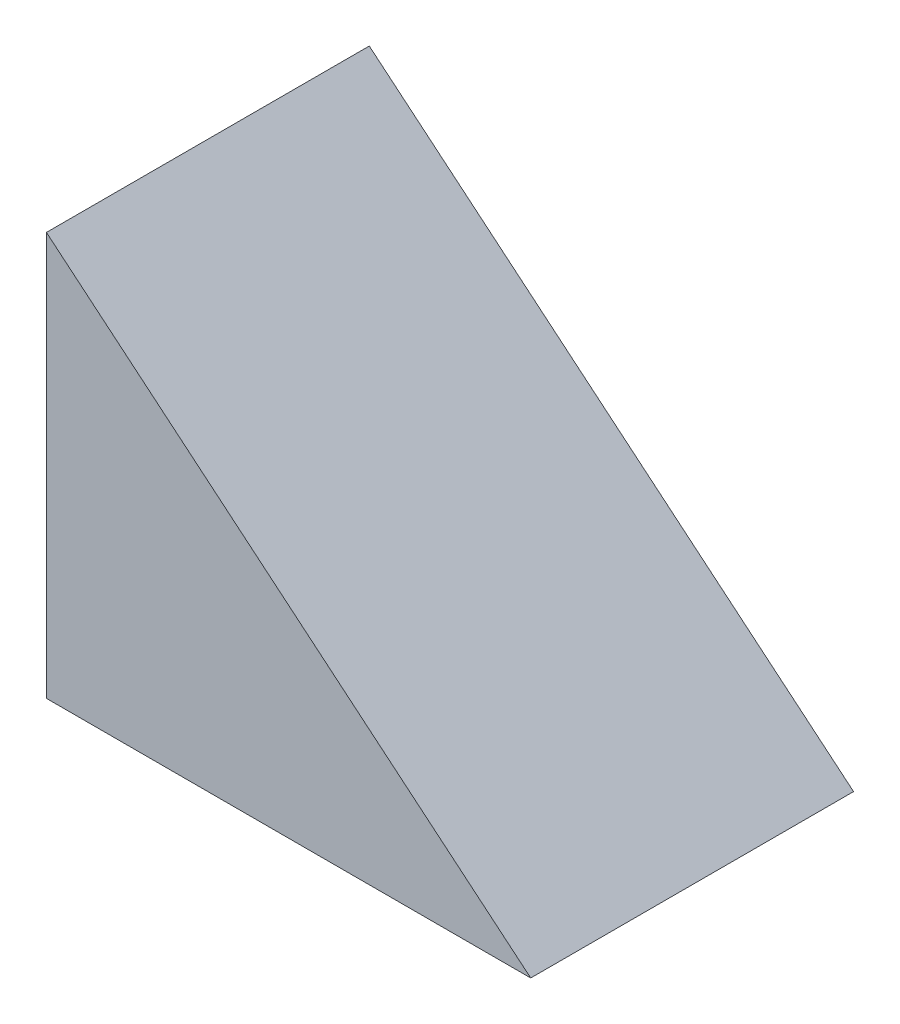
ISO-10303-21;
HEADER;
FILE_DESCRIPTION(('STEP AP214'),'2;1');
FILE_NAME('part.step','',(''),(''),'','','');
FILE_SCHEMA(('AUTOMOTIVE_DESIGN { 1 0 10303 214 1 1 1 1 }'));
ENDSEC;
DATA;
#1=APPLICATION_CONTEXT('core data for automotive mechanical design processes');
#2=APPLICATION_PROTOCOL_DEFINITION('international standard','automotive_design',2000,#1);
#3=PRODUCT_CONTEXT('',#1,'mechanical');
#4=PRODUCT('Part','Part','',(#3));
#5=PRODUCT_RELATED_PRODUCT_CATEGORY('part','',(#4));
#6=PRODUCT_DEFINITION_FORMATION('','',#4);
#7=PRODUCT_DEFINITION_CONTEXT('part definition',#1,'design');
#8=PRODUCT_DEFINITION('design','',#6,#7);
#9=PRODUCT_DEFINITION_SHAPE('','',#8);
#10=(LENGTH_UNIT() NAMED_UNIT(*) SI_UNIT(.MILLI.,.METRE.));
#11=(NAMED_UNIT(*) PLANE_ANGLE_UNIT() SI_UNIT($,.RADIAN.));
#12=(NAMED_UNIT(*) SI_UNIT($,.STERADIAN.) SOLID_ANGLE_UNIT());
#13=UNCERTAINTY_MEASURE_WITH_UNIT(LENGTH_MEASURE(1.E-05),#10,'distance_accuracy_value','');
#14=(GEOMETRIC_REPRESENTATION_CONTEXT(3) GLOBAL_UNCERTAINTY_ASSIGNED_CONTEXT((#13)) GLOBAL_UNIT_ASSIGNED_CONTEXT((#10,
#11,#12)) REPRESENTATION_CONTEXT('',''));
#15=CARTESIAN_POINT('',(0.,0.,0.));
#16=DIRECTION('',(0.,0.,1.));
#17=DIRECTION('',(1.,0.,0.));
#18=AXIS2_PLACEMENT_3D('',#15,#16,#17);
#19=CARTESIAN_POINT('',(30.,0.,20.));
#20=DIRECTION('',(0.,1.,0.));
#21=DIRECTION('',(-1.,0.,0.));
#22=AXIS2_PLACEMENT_3D('',#19,#20,#21);
#23=PLANE('',#22);
#24=DIRECTION('',(1.,0.,0.));
#25=VECTOR('',#24,1.);
#26=CARTESIAN_POINT('',(30.,0.,0.));
#27=LINE('',#26,#25);
#28=CARTESIAN_POINT('',(0.,0.,0.));
#29=VERTEX_POINT('',#28);
#30=CARTESIAN_POINT('',(30.,0.,0.));
#31=VERTEX_POINT('',#30);
#32=EDGE_CURVE('E85',#29,#31,#27,.T.);
#33=ORIENTED_EDGE('',*,*,#32,.T.);
#34=DIRECTION('',(0.,0.,-1.));
#35=VECTOR('',#34,1.);
#36=CARTESIAN_POINT('',(30.,0.,20.));
#37=LINE('',#36,#35);
#38=CARTESIAN_POINT('',(30.,0.,20.));
#39=VERTEX_POINT('',#38);
#40=EDGE_CURVE('E11',#39,#31,#37,.T.);
#41=ORIENTED_EDGE('',*,*,#40,.F.);
#42=DIRECTION('',(1.,0.,0.));
#43=VECTOR('',#42,1.);
#44=CARTESIAN_POINT('',(30.,0.,20.));
#45=LINE('',#44,#43);
#46=CARTESIAN_POINT('',(0.,0.,20.));
#47=VERTEX_POINT('',#46);
#48=EDGE_CURVE('E78',#47,#39,#45,.T.);
#49=ORIENTED_EDGE('',*,*,#48,.F.);
#50=DIRECTION('',(0.,0.,-1.));
#51=VECTOR('',#50,1.);
#52=CARTESIAN_POINT('',(0.,0.,20.));
#53=LINE('',#52,#51);
#54=EDGE_CURVE('E86',#47,#29,#53,.T.);
#55=ORIENTED_EDGE('',*,*,#54,.T.);
#56=EDGE_LOOP('',(#33,#41,#49,#55));
#57=FACE_BOUND('',#56,.T.);
#58=ADVANCED_FACE('F38',(#57),#23,.F.);
#59=CARTESIAN_POINT('',(0.,25.,20.));
#60=DIRECTION('',(-0.64018439966448,-0.768221279597376,0.));
#61=DIRECTION('',(0.768221279597376,-0.64018439966448,0.));
#62=AXIS2_PLACEMENT_3D('',#59,#60,#61);
#63=PLANE('',#62);
#64=DIRECTION('',(-0.768221279597376,0.64018439966448,0.));
#65=VECTOR('',#64,1.);
#66=CARTESIAN_POINT('',(0.,25.,0.));
#67=LINE('',#66,#65);
#68=CARTESIAN_POINT('',(0.,25.,0.));
#69=VERTEX_POINT('',#68);
#70=EDGE_CURVE('E66',#31,#69,#67,.T.);
#71=ORIENTED_EDGE('',*,*,#70,.T.);
#72=DIRECTION('',(0.,0.,-1.));
#73=VECTOR('',#72,1.);
#74=CARTESIAN_POINT('',(0.,25.,20.));
#75=LINE('',#74,#73);
#76=CARTESIAN_POINT('',(0.,25.,20.));
#77=VERTEX_POINT('',#76);
#78=EDGE_CURVE('E46',#77,#69,#75,.T.);
#79=ORIENTED_EDGE('',*,*,#78,.F.);
#80=DIRECTION('',(-0.768221279597376,0.64018439966448,0.));
#81=VECTOR('',#80,1.);
#82=CARTESIAN_POINT('',(0.,25.,20.));
#83=LINE('',#82,#81);
#84=EDGE_CURVE('E74',#39,#77,#83,.T.);
#85=ORIENTED_EDGE('',*,*,#84,.F.);
#86=ORIENTED_EDGE('',*,*,#40,.T.);
#87=EDGE_LOOP('',(#71,#79,#85,#86));
#88=FACE_BOUND('',#87,.T.);
#89=ADVANCED_FACE('F75',(#88),#63,.F.);
#90=CARTESIAN_POINT('',(0.,0.,20.));
#91=DIRECTION('',(1.,0.,0.));
#92=DIRECTION('',(0.,0.,-1.));
#93=AXIS2_PLACEMENT_3D('',#90,#91,#92);
#94=PLANE('',#93);
#95=DIRECTION('',(0.,-1.,0.));
#96=VECTOR('',#95,1.);
#97=CARTESIAN_POINT('',(0.,0.,0.));
#98=LINE('',#97,#96);
#99=EDGE_CURVE('E71',#69,#29,#98,.T.);
#100=ORIENTED_EDGE('',*,*,#99,.T.);
#101=ORIENTED_EDGE('',*,*,#54,.F.);
#102=DIRECTION('',(0.,-1.,0.));
#103=VECTOR('',#102,1.);
#104=CARTESIAN_POINT('',(0.,0.,20.));
#105=LINE('',#104,#103);
#106=EDGE_CURVE('E54',#77,#47,#105,.T.);
#107=ORIENTED_EDGE('',*,*,#106,.F.);
#108=ORIENTED_EDGE('',*,*,#78,.T.);
#109=EDGE_LOOP('',(#100,#101,#107,#108));
#110=FACE_BOUND('',#109,.T.);
#111=ADVANCED_FACE('F93',(#110),#94,.F.);
#112=CARTESIAN_POINT('',(0.,0.,20.));
#113=DIRECTION('',(0.,0.,-1.));
#114=DIRECTION('',(-1.,0.,0.));
#115=AXIS2_PLACEMENT_3D('',#112,#113,#114);
#116=PLANE('',#115);
#117=ORIENTED_EDGE('',*,*,#48,.T.);
#118=ORIENTED_EDGE('',*,*,#84,.T.);
#119=ORIENTED_EDGE('',*,*,#106,.T.);
#120=EDGE_LOOP('',(#117,#118,#119));
#121=FACE_BOUND('',#120,.T.);
#122=ADVANCED_FACE('F81',(#121),#116,.F.);
#123=CARTESIAN_POINT('',(0.,0.,0.));
#124=DIRECTION('',(0.,0.,-1.));
#125=DIRECTION('',(-1.,0.,0.));
#126=AXIS2_PLACEMENT_3D('',#123,#124,#125);
#127=PLANE('',#126);
#128=ORIENTED_EDGE('',*,*,#32,.F.);
#129=ORIENTED_EDGE('',*,*,#99,.F.);
#130=ORIENTED_EDGE('',*,*,#70,.F.);
#131=EDGE_LOOP('',(#128,#129,#130));
#132=FACE_BOUND('',#131,.T.);
#133=ADVANCED_FACE('F94',(#132),#127,.T.);
#134=CLOSED_SHELL('',(#58,#89,#111,#122,#133));
#135=MANIFOLD_SOLID_BREP('B2',#134);
#136=ADVANCED_BREP_SHAPE_REPRESENTATION('',(#18,#135),#14);
#137=SHAPE_DEFINITION_REPRESENTATION(#9,#136);
ENDSEC;
END-ISO-10303-21;
